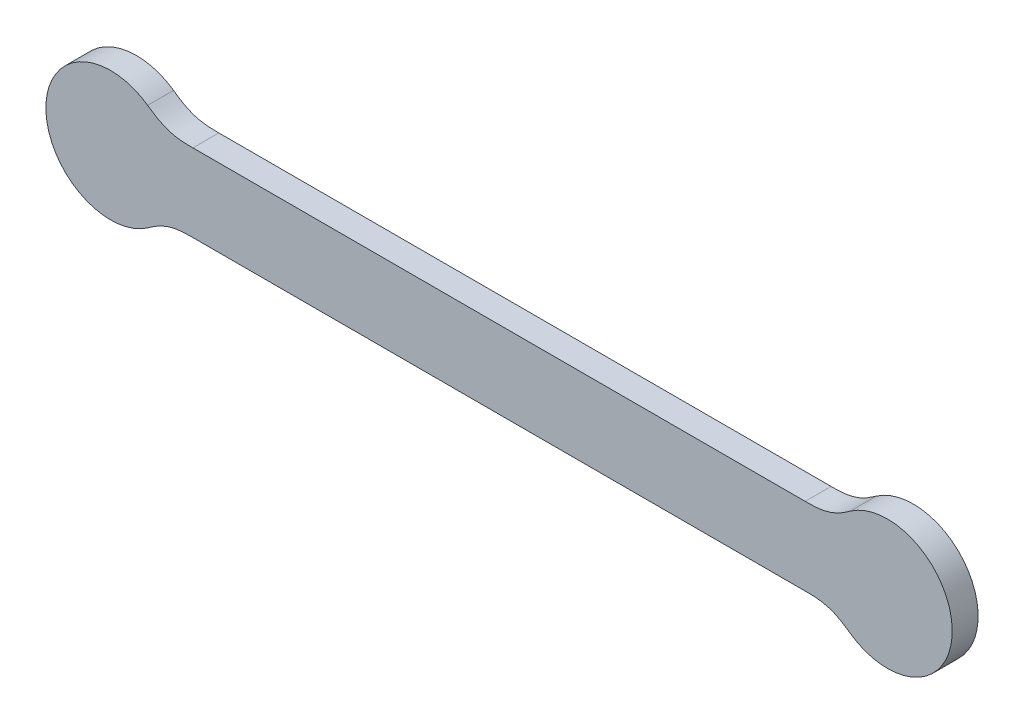
ISO-10303-21;
HEADER;
FILE_DESCRIPTION(('STEP AP214'),'2;1');
FILE_NAME('part.step','',(''),(''),'','','');
FILE_SCHEMA(('AUTOMOTIVE_DESIGN { 1 0 10303 214 1 1 1 1 }'));
ENDSEC;
DATA;
#1=APPLICATION_CONTEXT('core data for automotive mechanical design processes');
#2=APPLICATION_PROTOCOL_DEFINITION('international standard','automotive_design',2000,#1);
#3=PRODUCT_CONTEXT('',#1,'mechanical');
#4=PRODUCT('Part','Part','',(#3));
#5=PRODUCT_RELATED_PRODUCT_CATEGORY('part','',(#4));
#6=PRODUCT_DEFINITION_FORMATION('','',#4);
#7=PRODUCT_DEFINITION_CONTEXT('part definition',#1,'design');
#8=PRODUCT_DEFINITION('design','',#6,#7);
#9=PRODUCT_DEFINITION_SHAPE('','',#8);
#10=(LENGTH_UNIT() NAMED_UNIT(*) SI_UNIT(.MILLI.,.METRE.));
#11=(NAMED_UNIT(*) PLANE_ANGLE_UNIT() SI_UNIT($,.RADIAN.));
#12=(NAMED_UNIT(*) SI_UNIT($,.STERADIAN.) SOLID_ANGLE_UNIT());
#13=UNCERTAINTY_MEASURE_WITH_UNIT(LENGTH_MEASURE(1.E-05),#10,'distance_accuracy_value','');
#14=(GEOMETRIC_REPRESENTATION_CONTEXT(3) GLOBAL_UNCERTAINTY_ASSIGNED_CONTEXT((#13)) GLOBAL_UNIT_ASSIGNED_CONTEXT((#10,
#11,#12)) REPRESENTATION_CONTEXT('',''));
#15=CARTESIAN_POINT('',(0.,0.,0.));
#16=DIRECTION('',(0.,0.,1.));
#17=DIRECTION('',(1.,0.,0.));
#18=AXIS2_PLACEMENT_3D('',#15,#16,#17);
#19=CARTESIAN_POINT('',(63.560994328244,30.0000000000608,20.));
#20=CARTESIAN_POINT('',(62.7872582769109,29.9999911086348,20.));
#21=CARTESIAN_POINT('',(62.3868019946968,30.000683506393,20.));
#22=CARTESIAN_POINT('',(61.7360385844248,30.0018086907049,20.));
#23=CARTESIAN_POINT('',(61.2128180486898,30.0053667871525,20.));
#24=CARTESIAN_POINT('',(60.5917110680237,30.0095905482447,20.));
#25=CARTESIAN_POINT('',(60.0392431796509,30.017901856522,20.));
#26=CARTESIAN_POINT('',(59.427508131008,30.0271047779594,20.));
#27=CARTESIAN_POINT('',(58.8662616132109,30.0418247272716,20.));
#28=CARTESIAN_POINT('',(57.630767285642,30.0742283383421,20.));
#29=CARTESIAN_POINT('',(56.5227550754297,30.1368221512111,20.));
#30=CARTESIAN_POINT('',(55.3124578234751,30.2051942494664,20.));
#31=CARTESIAN_POINT('',(54.183496162657,30.3133481377789,20.));
#32=CARTESIAN_POINT('',(52.9879711189895,30.4278787605052,20.));
#33=CARTESIAN_POINT('',(51.8494677845407,30.5902685733549,20.));
#34=CARTESIAN_POINT('',(50.6704786241827,30.758433060282,20.));
#35=CARTESIAN_POINT('',(49.5345075933127,30.9805860734805,20.));
#36=CARTESIAN_POINT('',(48.379387223232,31.2064839739083,20.));
#37=CARTESIAN_POINT('',(47.2586696989515,31.4902667294088,20.));
#38=CARTESIAN_POINT('',(46.1270551473777,31.7768087782772,20.));
#39=CARTESIAN_POINT('',(45.0237226557853,32.1242714707231,20.));
#40=CARTESIAN_POINT('',(43.9238417271821,32.4706471931227,20.));
#41=CARTESIAN_POINT('',(42.8305282302557,32.8852204024476,20.));
#42=CARTESIAN_POINT('',(41.7598509961034,33.2912101742391,20.));
#43=CARTESIAN_POINT('',(40.6777681374749,33.7691054259936,20.));
#44=CARTESIAN_POINT('',(39.6275067291394,34.2329469295739,20.));
#45=CARTESIAN_POINT('',(38.5622971291976,34.7663637638698,20.));
#46=CARTESIAN_POINT('',(37.5289508574445,35.283824643907,20.));
#47=CARTESIAN_POINT('',(36.4849799236338,35.8652119956421,20.));
#48=CARTESIAN_POINT('',(35.4746795814725,36.4278481968648,20.));
#49=CARTESIAN_POINT('',(34.45873878953,37.0481852005326,20.));
#50=CARTESIAN_POINT('',(33.4784989283344,37.6467230909219,20.));
#51=CARTESIAN_POINT('',(32.4808720459842,38.3070516798302,20.));
#52=CARTESIAN_POINT('',(32.0046966142756,38.6222318904439,20.));
#53=CARTESIAN_POINT('',(31.5084478581512,38.9623857321312,20.));
#54=CARTESIAN_POINT('',(31.0539115406918,39.2739477716571,20.));
#55=CARTESIAN_POINT('',(30.5453432685858,39.6323410503651,20.));
#56=CARTESIAN_POINT('',(30.3305028033462,39.7837413302479,20.));
#57=CARTESIAN_POINT('',(30.0664658567978,39.9715152596076,20.));
#58=CARTESIAN_POINT('',(29.8911606705376,40.0961862349825,20.));
#59=CARTESIAN_POINT('',(29.5885287781165,40.3121647351301,20.));
#60=CARTESIAN_POINT('',(29.2461249392275,40.5565271748465,20.));
#61=CARTESIAN_POINT('',(29.1105906975946,40.6528126392728,20.));
#62=CARTESIAN_POINT('',(28.8427226240291,40.8431099512841,20.));
#63=CARTESIAN_POINT('',(28.6310785262552,40.9909909910236,20.));
#64=B_SPLINE_CURVE_WITH_KNOTS('',2,(#19,#20,#21,#22,#23,#24,#25,#26,#27,#28,#29,#30,#31,#32,#33,
#34,#35,#36,#37,#38,#39,#40,#41,#42,#43,#44,#45,#46,#47,#48,#49,#50,#51,#52,#53,#54,#55,#56,#57,
#58,#59,#60,#61,#62,#63),.UNSPECIFIED.,.F.,.F.,(3,2,2,2,2,2,2,2,2,2,2,2,2,2,2,2,2,2,2,2,2,2,3),
(0.,0.03125,0.0625,0.09375,0.125,0.1875,0.25,0.3125,0.375,0.4375,0.5,0.5625,0.625,0.6875,0.75,
0.8125,0.875,0.90625,0.9375,0.953125,0.96875,0.984375,1.),.UNSPECIFIED.);
#65=DIRECTION('',(0.,0.,-1.));
#66=VECTOR('',#65,1.);
#67=SURFACE_OF_LINEAR_EXTRUSION('',#64,#66);
#68=CARTESIAN_POINT('',(63.560994328244,30.0000000000608,0.));
#69=CARTESIAN_POINT('',(62.7872582769109,29.9999911086348,0.));
#70=CARTESIAN_POINT('',(62.3868019946968,30.000683506393,0.));
#71=CARTESIAN_POINT('',(61.7360385844248,30.0018086907049,0.));
#72=CARTESIAN_POINT('',(61.2128180486898,30.0053667871525,0.));
#73=CARTESIAN_POINT('',(60.5917110680237,30.0095905482447,0.));
#74=CARTESIAN_POINT('',(60.0392431796509,30.017901856522,0.));
#75=CARTESIAN_POINT('',(59.427508131008,30.0271047779594,0.));
#76=CARTESIAN_POINT('',(58.8662616132109,30.0418247272716,0.));
#77=CARTESIAN_POINT('',(57.630767285642,30.0742283383421,0.));
#78=CARTESIAN_POINT('',(56.5227550754297,30.1368221512111,0.));
#79=CARTESIAN_POINT('',(55.3124578234751,30.2051942494664,0.));
#80=CARTESIAN_POINT('',(54.183496162657,30.3133481377789,0.));
#81=CARTESIAN_POINT('',(52.9879711189895,30.4278787605052,0.));
#82=CARTESIAN_POINT('',(51.8494677845407,30.5902685733549,0.));
#83=CARTESIAN_POINT('',(50.6704786241827,30.758433060282,0.));
#84=CARTESIAN_POINT('',(49.5345075933127,30.9805860734805,0.));
#85=CARTESIAN_POINT('',(48.379387223232,31.2064839739083,0.));
#86=CARTESIAN_POINT('',(47.2586696989515,31.4902667294088,0.));
#87=CARTESIAN_POINT('',(46.1270551473777,31.7768087782772,0.));
#88=CARTESIAN_POINT('',(45.0237226557853,32.1242714707231,0.));
#89=CARTESIAN_POINT('',(43.9238417271821,32.4706471931227,0.));
#90=CARTESIAN_POINT('',(42.8305282302557,32.8852204024476,0.));
#91=CARTESIAN_POINT('',(41.7598509961034,33.2912101742391,0.));
#92=CARTESIAN_POINT('',(40.6777681374749,33.7691054259936,0.));
#93=CARTESIAN_POINT('',(39.6275067291394,34.2329469295739,0.));
#94=CARTESIAN_POINT('',(38.5622971291976,34.7663637638698,0.));
#95=CARTESIAN_POINT('',(37.5289508574445,35.283824643907,0.));
#96=CARTESIAN_POINT('',(36.4849799236338,35.8652119956421,0.));
#97=CARTESIAN_POINT('',(35.4746795814725,36.4278481968648,0.));
#98=CARTESIAN_POINT('',(34.45873878953,37.0481852005326,0.));
#99=CARTESIAN_POINT('',(33.4784989283344,37.6467230909219,0.));
#100=CARTESIAN_POINT('',(32.4808720459842,38.3070516798302,0.));
#101=CARTESIAN_POINT('',(32.0046966142756,38.6222318904439,0.));
#102=CARTESIAN_POINT('',(31.5084478581512,38.9623857321312,0.));
#103=CARTESIAN_POINT('',(31.0539115406918,39.2739477716571,0.));
#104=CARTESIAN_POINT('',(30.5453432685858,39.6323410503651,0.));
#105=CARTESIAN_POINT('',(30.3305028033462,39.7837413302479,0.));
#106=CARTESIAN_POINT('',(30.0664658567978,39.9715152596076,0.));
#107=CARTESIAN_POINT('',(29.8911606705376,40.0961862349825,0.));
#108=CARTESIAN_POINT('',(29.5885287781165,40.3121647351301,0.));
#109=CARTESIAN_POINT('',(29.2461249392275,40.5565271748465,0.));
#110=CARTESIAN_POINT('',(29.1105906975946,40.6528126392728,0.));
#111=CARTESIAN_POINT('',(28.8427226240291,40.8431099512841,0.));
#112=CARTESIAN_POINT('',(28.6310785262552,40.9909909910236,0.));
#113=B_SPLINE_CURVE_WITH_KNOTS('',2,(#68,#69,#70,#71,#72,#73,#74,#75,#76,#77,#78,#79,#80,#81,
#82,#83,#84,#85,#86,#87,#88,#89,#90,#91,#92,#93,#94,#95,#96,#97,#98,#99,#100,#101,#102,#103,
#104,#105,#106,#107,#108,#109,#110,#111,#112),.UNSPECIFIED.,.F.,.F.,(3,2,2,2,2,2,2,2,2,2,2,2,2,
2,2,2,2,2,2,2,2,2,3),(0.,0.03125,0.0625,0.09375,0.125,0.1875,0.25,0.3125,0.375,0.4375,0.5,
0.5625,0.625,0.6875,0.75,0.8125,0.875,0.90625,0.9375,0.953125,0.96875,0.984375,1.),.UNSPECIFIED.);
#114=CARTESIAN_POINT('',(63.560994328244,30.0000000000608,0.));
#115=VERTEX_POINT('',#114);
#116=CARTESIAN_POINT('',(28.6310785262552,40.9909909910236,0.));
#117=VERTEX_POINT('',#116);
#118=EDGE_CURVE('E343',#115,#117,#113,.T.);
#119=ORIENTED_EDGE('',*,*,#118,.T.);
#120=DIRECTION('',(0.,0.,-1.));
#121=VECTOR('',#120,1.);
#122=CARTESIAN_POINT('',(28.6310785262552,40.9909909910236,20.));
#123=LINE('',#122,#121);
#124=CARTESIAN_POINT('',(28.6310785262552,40.9909909910236,20.));
#125=VERTEX_POINT('',#124);
#126=EDGE_CURVE('E12',#125,#117,#123,.T.);
#127=ORIENTED_EDGE('',*,*,#126,.F.);
#128=CARTESIAN_POINT('',(28.6310785262552,40.9909909910236,20.));
#129=CARTESIAN_POINT('',(28.8427226240291,40.8431099512841,20.));
#130=CARTESIAN_POINT('',(29.1105906975946,40.6528126392728,20.));
#131=CARTESIAN_POINT('',(29.2461249392275,40.5565271748465,20.));
#132=CARTESIAN_POINT('',(29.5885287781165,40.3121647351301,20.));
#133=CARTESIAN_POINT('',(29.8911606705376,40.0961862349825,20.));
#134=CARTESIAN_POINT('',(30.0664658567978,39.9715152596076,20.));
#135=CARTESIAN_POINT('',(30.3305028033462,39.7837413302479,20.));
#136=CARTESIAN_POINT('',(30.5453432685858,39.6323410503651,20.));
#137=CARTESIAN_POINT('',(31.0539115406918,39.2739477716571,20.));
#138=CARTESIAN_POINT('',(31.5084478581512,38.9623857321312,20.));
#139=CARTESIAN_POINT('',(32.0046966142756,38.6222318904439,20.));
#140=CARTESIAN_POINT('',(32.4808720459842,38.3070516798302,20.));
#141=CARTESIAN_POINT('',(33.4784989283344,37.6467230909219,20.));
#142=CARTESIAN_POINT('',(34.45873878953,37.0481852005326,20.));
#143=CARTESIAN_POINT('',(35.4746795814725,36.4278481968648,20.));
#144=CARTESIAN_POINT('',(36.4849799236338,35.8652119956421,20.));
#145=CARTESIAN_POINT('',(37.5289508574445,35.283824643907,20.));
#146=CARTESIAN_POINT('',(38.5622971291976,34.7663637638698,20.));
#147=CARTESIAN_POINT('',(39.6275067291394,34.2329469295739,20.));
#148=CARTESIAN_POINT('',(40.6777681374749,33.7691054259936,20.));
#149=CARTESIAN_POINT('',(41.7598509961034,33.2912101742391,20.));
#150=CARTESIAN_POINT('',(42.8305282302557,32.8852204024476,20.));
#151=CARTESIAN_POINT('',(43.9238417271821,32.4706471931227,20.));
#152=CARTESIAN_POINT('',(45.0237226557853,32.1242714707231,20.));
#153=CARTESIAN_POINT('',(46.1270551473777,31.7768087782772,20.));
#154=CARTESIAN_POINT('',(47.2586696989515,31.4902667294088,20.));
#155=CARTESIAN_POINT('',(48.379387223232,31.2064839739083,20.));
#156=CARTESIAN_POINT('',(49.5345075933127,30.9805860734805,20.));
#157=CARTESIAN_POINT('',(50.6704786241827,30.758433060282,20.));
#158=CARTESIAN_POINT('',(51.8494677845407,30.5902685733549,20.));
#159=CARTESIAN_POINT('',(52.9879711189895,30.4278787605052,20.));
#160=CARTESIAN_POINT('',(54.183496162657,30.3133481377789,20.));
#161=CARTESIAN_POINT('',(55.3124578234751,30.2051942494664,20.));
#162=CARTESIAN_POINT('',(56.5227550754297,30.1368221512111,20.));
#163=CARTESIAN_POINT('',(57.630767285642,30.0742283383421,20.));
#164=CARTESIAN_POINT('',(58.8662616132109,30.0418247272716,20.));
#165=CARTESIAN_POINT('',(59.427508131008,30.0271047779594,20.));
#166=CARTESIAN_POINT('',(60.0392431796509,30.017901856522,20.));
#167=CARTESIAN_POINT('',(60.5917110680237,30.0095905482447,20.));
#168=CARTESIAN_POINT('',(61.2128180486898,30.0053667871525,20.));
#169=CARTESIAN_POINT('',(61.7360385844248,30.0018086907049,20.));
#170=CARTESIAN_POINT('',(62.3868019946968,30.000683506393,20.));
#171=CARTESIAN_POINT('',(62.7872582769109,29.9999911086348,20.));
#172=CARTESIAN_POINT('',(63.560994328244,30.0000000000608,20.));
#173=B_SPLINE_CURVE_WITH_KNOTS('',2,(#128,#129,#130,#131,#132,#133,#134,#135,#136,#137,#138,
#139,#140,#141,#142,#143,#144,#145,#146,#147,#148,#149,#150,#151,#152,#153,#154,#155,#156,#157,
#158,#159,#160,#161,#162,#163,#164,#165,#166,#167,#168,#169,#170,#171,#172),.UNSPECIFIED.,.F.,
.F.,(3,2,2,2,2,2,2,2,2,2,2,2,2,2,2,2,2,2,2,2,2,2,3),(0.,0.015625,0.03125,0.046875,0.0625,
0.09375,0.125,0.1875,0.25,0.3125,0.375,0.4375,0.5,0.5625,0.625,0.6875,0.75,0.8125,0.875,0.90625,
0.9375,0.96875,1.),.UNSPECIFIED.);
#174=CARTESIAN_POINT('',(63.560994328244,30.0000000000608,20.));
#175=VERTEX_POINT('',#174);
#176=EDGE_CURVE('E286',#175,#125,#173,.F.);
#177=ORIENTED_EDGE('',*,*,#176,.F.);
#178=DIRECTION('',(0.,0.,-1.));
#179=VECTOR('',#178,1.);
#180=CARTESIAN_POINT('',(63.560994328244,30.0000000000608,20.));
#181=LINE('',#180,#179);
#182=EDGE_CURVE('E374',#175,#115,#181,.T.);
#183=ORIENTED_EDGE('',*,*,#182,.T.);
#184=EDGE_LOOP('',(#119,#127,#177,#183));
#185=FACE_BOUND('',#184,.T.);
#186=ADVANCED_FACE('F38',(#185),#67,.F.);
#187=CARTESIAN_POINT('',(0.,-4.038869932943E-11,20.));
#188=DIRECTION('',(0.,0.,-1.));
#189=DIRECTION('',(-1.,0.,0.));
#190=AXIS2_PLACEMENT_3D('',#187,#188,#189);
#191=CYLINDRICAL_SURFACE('',#190,50.0000000000607);
#192=CARTESIAN_POINT('',(0.,-4.038869932943E-11,0.));
#193=DIRECTION('',(0.,0.,1.));
#194=DIRECTION('',(1.,0.,0.));
#195=AXIS2_PLACEMENT_3D('',#192,#193,#194);
#196=CIRCLE('',#195,50.0000000000607);
#197=CARTESIAN_POINT('',(28.6310785263075,-40.9909909910678,0.));
#198=VERTEX_POINT('',#197);
#199=EDGE_CURVE('E340',#117,#198,#196,.T.);
#200=ORIENTED_EDGE('',*,*,#199,.T.);
#201=DIRECTION('',(0.,0.,-1.));
#202=VECTOR('',#201,1.);
#203=CARTESIAN_POINT('',(28.6310785263075,-40.9909909910678,20.));
#204=LINE('',#203,#202);
#205=CARTESIAN_POINT('',(28.6310785263075,-40.9909909910678,20.));
#206=VERTEX_POINT('',#205);
#207=EDGE_CURVE('E52',#206,#198,#204,.T.);
#208=ORIENTED_EDGE('',*,*,#207,.F.);
#209=CARTESIAN_POINT('',(0.,-4.038869932943E-11,20.));
#210=DIRECTION('',(0.,0.,1.));
#211=DIRECTION('',(1.,0.,0.));
#212=AXIS2_PLACEMENT_3D('',#209,#210,#211);
#213=CIRCLE('',#212,50.0000000000607);
#214=EDGE_CURVE('E105',#125,#206,#213,.T.);
#215=ORIENTED_EDGE('',*,*,#214,.F.);
#216=ORIENTED_EDGE('',*,*,#126,.T.);
#217=EDGE_LOOP('',(#200,#208,#215,#216));
#218=FACE_BOUND('',#217,.T.);
#219=ADVANCED_FACE('F273',(#218),#191,.T.);
#220=CARTESIAN_POINT('',(28.6310785263075,-40.9909909910678,20.));
#221=CARTESIAN_POINT('',(28.8423316236983,-40.8433832907698,20.));
#222=CARTESIAN_POINT('',(29.110430921913,-40.6529260935813,20.));
#223=CARTESIAN_POINT('',(29.2456441806587,-40.5568708690622,20.));
#224=CARTESIAN_POINT('',(29.5882382815007,-40.3123720693596,20.));
#225=CARTESIAN_POINT('',(29.8901004871767,-40.0969423617786,20.));
#226=CARTESIAN_POINT('',(30.0660439271277,-39.9718152842582,20.));
#227=CARTESIAN_POINT('',(30.3291626089841,-39.7846911055397,20.));
#228=CARTESIAN_POINT('',(30.5447716018993,-39.6327439328909,20.));
#229=CARTESIAN_POINT('',(31.0522487463738,-39.2751071003812,20.));
#230=CARTESIAN_POINT('',(31.5074734932845,-38.9630536430185,20.));
#231=CARTESIAN_POINT('',(32.0025269885528,-38.6236978504647,20.));
#232=CARTESIAN_POINT('',(32.4793126888117,-38.3080839630025,20.));
#233=CARTESIAN_POINT('',(33.4752052966464,-37.6488411684242,20.));
#234=CARTESIAN_POINT('',(34.4553402564401,-37.0502605881829,20.));
#235=CARTESIAN_POINT('',(35.4690472058236,-36.4311771773796,20.));
#236=CARTESIAN_POINT('',(36.478708489062,-35.8687051638327,20.));
#237=CARTESIAN_POINT('',(37.5203821388376,-35.288399387059,20.));
#238=CARTESIAN_POINT('',(38.5538670948265,-34.7705863708479,20.));
#239=CARTESIAN_POINT('',(39.6224137498922,-34.2352061863416,20.));
#240=CARTESIAN_POINT('',(40.6782097692361,-33.7689103816151,20.));
#241=CARTESIAN_POINT('',(41.7627766450492,-33.2899078329494,20.));
#242=CARTESIAN_POINT('',(42.8374461805422,-32.882597911742,20.));
#243=CARTESIAN_POINT('',(43.9312606111946,-32.4680318941428,20.));
#244=CARTESIAN_POINT('',(45.03358197743,-32.1211675772975,20.));
#245=CARTESIAN_POINT('',(46.1354299153353,-31.7744522327929,20.));
#246=CARTESIAN_POINT('',(47.2676166841441,-31.4880021642029,20.));
#247=CARTESIAN_POINT('',(48.3849371924496,-31.2053133490192,20.));
#248=CARTESIAN_POINT('',(49.5385721884592,-30.9797913532913,20.));
#249=CARTESIAN_POINT('',(50.6690242894101,-30.7588013393242,20.));
#250=CARTESIAN_POINT('',(51.84479394927,-30.5909355221532,20.));
#251=CARTESIAN_POINT('',(52.982171569797,-30.4285509750605,20.));
#252=CARTESIAN_POINT('',(54.179318923496,-30.3137485167954,20.));
#253=CARTESIAN_POINT('',(55.3081505146757,-30.2054973134374,20.));
#254=CARTESIAN_POINT('',(56.5204973826881,-30.1369497469401,20.));
#255=CARTESIAN_POINT('',(57.6280168846641,-30.0743292472202,20.));
#256=CARTESIAN_POINT('',(58.8651980183634,-30.0418526347757,20.));
#257=CARTESIAN_POINT('',(59.4255485991439,-30.0271431567944,20.));
#258=CARTESIAN_POINT('',(60.0385660764652,-30.0179119433742,20.));
#259=CARTESIAN_POINT('',(60.5900680022349,-30.0096070708921,20.));
#260=CARTESIAN_POINT('',(61.2124255137652,-30.0053694590248,20.));
#261=CARTESIAN_POINT('',(61.7346904729739,-30.0018133740607,20.));
#262=CARTESIAN_POINT('',(62.386623659473,-30.0006837743087,20.));
#263=CARTESIAN_POINT('',(62.7863671287599,-29.9999911417919,20.));
#264=CARTESIAN_POINT('',(63.5609943283602,-30.0000000000604,20.));
#265=B_SPLINE_CURVE_WITH_KNOTS('',2,(#220,#221,#222,#223,#224,#225,#226,#227,#228,#229,#230,
#231,#232,#233,#234,#235,#236,#237,#238,#239,#240,#241,#242,#243,#244,#245,#246,#247,#248,#249,
#250,#251,#252,#253,#254,#255,#256,#257,#258,#259,#260,#261,#262,#263,#264),.UNSPECIFIED.,.F.,
.F.,(3,2,2,2,2,2,2,2,2,2,2,2,2,2,2,2,2,2,2,2,2,2,3),(0.,0.015625,0.03125,0.046875,0.0625,
0.09375,0.125,0.1875,0.25,0.3125,0.375,0.4375,0.5,0.5625,0.625,0.6875,0.75,0.8125,0.875,0.90625,
0.9375,0.96875,1.),.UNSPECIFIED.);
#266=DIRECTION('',(0.,0.,-1.));
#267=VECTOR('',#266,1.);
#268=SURFACE_OF_LINEAR_EXTRUSION('',#265,#267);
#269=CARTESIAN_POINT('',(28.6310785263075,-40.9909909910678,0.));
#270=CARTESIAN_POINT('',(28.8423316236983,-40.8433832907698,0.));
#271=CARTESIAN_POINT('',(29.110430921913,-40.6529260935813,0.));
#272=CARTESIAN_POINT('',(29.2456441806587,-40.5568708690622,0.));
#273=CARTESIAN_POINT('',(29.5882382815007,-40.3123720693596,0.));
#274=CARTESIAN_POINT('',(29.8901004871767,-40.0969423617786,0.));
#275=CARTESIAN_POINT('',(30.0660439271277,-39.9718152842582,0.));
#276=CARTESIAN_POINT('',(30.3291626089841,-39.7846911055397,0.));
#277=CARTESIAN_POINT('',(30.5447716018993,-39.6327439328909,0.));
#278=CARTESIAN_POINT('',(31.0522487463738,-39.2751071003812,0.));
#279=CARTESIAN_POINT('',(31.5074734932845,-38.9630536430185,0.));
#280=CARTESIAN_POINT('',(32.0025269885528,-38.6236978504647,0.));
#281=CARTESIAN_POINT('',(32.4793126888117,-38.3080839630025,0.));
#282=CARTESIAN_POINT('',(33.4752052966464,-37.6488411684242,0.));
#283=CARTESIAN_POINT('',(34.4553402564401,-37.0502605881829,0.));
#284=CARTESIAN_POINT('',(35.4690472058236,-36.4311771773796,0.));
#285=CARTESIAN_POINT('',(36.478708489062,-35.8687051638327,0.));
#286=CARTESIAN_POINT('',(37.5203821388376,-35.288399387059,0.));
#287=CARTESIAN_POINT('',(38.5538670948265,-34.7705863708479,0.));
#288=CARTESIAN_POINT('',(39.6224137498922,-34.2352061863416,0.));
#289=CARTESIAN_POINT('',(40.6782097692361,-33.7689103816151,0.));
#290=CARTESIAN_POINT('',(41.7627766450492,-33.2899078329494,0.));
#291=CARTESIAN_POINT('',(42.8374461805422,-32.882597911742,0.));
#292=CARTESIAN_POINT('',(43.9312606111946,-32.4680318941428,0.));
#293=CARTESIAN_POINT('',(45.03358197743,-32.1211675772975,0.));
#294=CARTESIAN_POINT('',(46.1354299153353,-31.7744522327929,0.));
#295=CARTESIAN_POINT('',(47.2676166841441,-31.4880021642029,0.));
#296=CARTESIAN_POINT('',(48.3849371924496,-31.2053133490192,0.));
#297=CARTESIAN_POINT('',(49.5385721884592,-30.9797913532913,0.));
#298=CARTESIAN_POINT('',(50.6690242894101,-30.7588013393242,0.));
#299=CARTESIAN_POINT('',(51.84479394927,-30.5909355221532,0.));
#300=CARTESIAN_POINT('',(52.982171569797,-30.4285509750605,0.));
#301=CARTESIAN_POINT('',(54.179318923496,-30.3137485167954,0.));
#302=CARTESIAN_POINT('',(55.3081505146757,-30.2054973134374,0.));
#303=CARTESIAN_POINT('',(56.5204973826881,-30.1369497469401,0.));
#304=CARTESIAN_POINT('',(57.6280168846641,-30.0743292472202,0.));
#305=CARTESIAN_POINT('',(58.8651980183634,-30.0418526347757,0.));
#306=CARTESIAN_POINT('',(59.4255485991439,-30.0271431567944,0.));
#307=CARTESIAN_POINT('',(60.0385660764652,-30.0179119433742,0.));
#308=CARTESIAN_POINT('',(60.5900680022349,-30.0096070708921,0.));
#309=CARTESIAN_POINT('',(61.2124255137652,-30.0053694590248,0.));
#310=CARTESIAN_POINT('',(61.7346904729739,-30.0018133740607,0.));
#311=CARTESIAN_POINT('',(62.386623659473,-30.0006837743087,0.));
#312=CARTESIAN_POINT('',(62.7863671287599,-29.9999911417919,0.));
#313=CARTESIAN_POINT('',(63.5609943283602,-30.0000000000604,0.));
#314=B_SPLINE_CURVE_WITH_KNOTS('',2,(#269,#270,#271,#272,#273,#274,#275,#276,#277,#278,#279,
#280,#281,#282,#283,#284,#285,#286,#287,#288,#289,#290,#291,#292,#293,#294,#295,#296,#297,#298,
#299,#300,#301,#302,#303,#304,#305,#306,#307,#308,#309,#310,#311,#312,#313),.UNSPECIFIED.,.F.,
.F.,(3,2,2,2,2,2,2,2,2,2,2,2,2,2,2,2,2,2,2,2,2,2,3),(0.,0.015625,0.03125,0.046875,0.0625,
0.09375,0.125,0.1875,0.25,0.3125,0.375,0.4375,0.5,0.5625,0.625,0.6875,0.75,0.8125,0.875,0.90625,
0.9375,0.96875,1.),.UNSPECIFIED.);
#315=CARTESIAN_POINT('',(63.5609943283602,-30.0000000000604,0.));
#316=VERTEX_POINT('',#315);
#317=EDGE_CURVE('E329',#198,#316,#314,.T.);
#318=ORIENTED_EDGE('',*,*,#317,.T.);
#319=DIRECTION('',(0.,0.,-1.));
#320=VECTOR('',#319,1.);
#321=CARTESIAN_POINT('',(63.5609943283602,-30.0000000000604,20.));
#322=LINE('',#321,#320);
#323=CARTESIAN_POINT('',(63.5609943283602,-30.0000000000604,20.));
#324=VERTEX_POINT('',#323);
#325=EDGE_CURVE('E292',#324,#316,#322,.T.);
#326=ORIENTED_EDGE('',*,*,#325,.F.);
#327=CARTESIAN_POINT('',(63.5609943283602,-30.0000000000604,20.));
#328=CARTESIAN_POINT('',(62.7863671287599,-29.9999911417919,20.));
#329=CARTESIAN_POINT('',(62.386623659473,-30.0006837743087,20.));
#330=CARTESIAN_POINT('',(61.7346904729739,-30.0018133740607,20.));
#331=CARTESIAN_POINT('',(61.2124255137652,-30.0053694590248,20.));
#332=CARTESIAN_POINT('',(60.5900680022349,-30.0096070708921,20.));
#333=CARTESIAN_POINT('',(60.0385660764652,-30.0179119433742,20.));
#334=CARTESIAN_POINT('',(59.4255485991439,-30.0271431567944,20.));
#335=CARTESIAN_POINT('',(58.8651980183634,-30.0418526347757,20.));
#336=CARTESIAN_POINT('',(57.6280168846641,-30.0743292472202,20.));
#337=CARTESIAN_POINT('',(56.5204973826881,-30.1369497469401,20.));
#338=CARTESIAN_POINT('',(55.3081505146757,-30.2054973134374,20.));
#339=CARTESIAN_POINT('',(54.179318923496,-30.3137485167954,20.));
#340=CARTESIAN_POINT('',(52.982171569797,-30.4285509750605,20.));
#341=CARTESIAN_POINT('',(51.84479394927,-30.5909355221532,20.));
#342=CARTESIAN_POINT('',(50.6690242894101,-30.7588013393242,20.));
#343=CARTESIAN_POINT('',(49.5385721884592,-30.9797913532913,20.));
#344=CARTESIAN_POINT('',(48.3849371924496,-31.2053133490192,20.));
#345=CARTESIAN_POINT('',(47.2676166841441,-31.4880021642029,20.));
#346=CARTESIAN_POINT('',(46.1354299153353,-31.7744522327929,20.));
#347=CARTESIAN_POINT('',(45.03358197743,-32.1211675772975,20.));
#348=CARTESIAN_POINT('',(43.9312606111946,-32.4680318941428,20.));
#349=CARTESIAN_POINT('',(42.8374461805422,-32.882597911742,20.));
#350=CARTESIAN_POINT('',(41.7627766450492,-33.2899078329494,20.));
#351=CARTESIAN_POINT('',(40.6782097692361,-33.7689103816151,20.));
#352=CARTESIAN_POINT('',(39.6224137498922,-34.2352061863416,20.));
#353=CARTESIAN_POINT('',(38.5538670948265,-34.7705863708479,20.));
#354=CARTESIAN_POINT('',(37.5203821388376,-35.288399387059,20.));
#355=CARTESIAN_POINT('',(36.478708489062,-35.8687051638327,20.));
#356=CARTESIAN_POINT('',(35.4690472058236,-36.4311771773796,20.));
#357=CARTESIAN_POINT('',(34.4553402564401,-37.0502605881829,20.));
#358=CARTESIAN_POINT('',(33.4752052966464,-37.6488411684242,20.));
#359=CARTESIAN_POINT('',(32.4793126888117,-38.3080839630025,20.));
#360=CARTESIAN_POINT('',(32.0025269885528,-38.6236978504647,20.));
#361=CARTESIAN_POINT('',(31.5074734932845,-38.9630536430185,20.));
#362=CARTESIAN_POINT('',(31.0522487463738,-39.2751071003812,20.));
#363=CARTESIAN_POINT('',(30.5447716018993,-39.6327439328909,20.));
#364=CARTESIAN_POINT('',(30.3291626089841,-39.7846911055397,20.));
#365=CARTESIAN_POINT('',(30.0660439271277,-39.9718152842582,20.));
#366=CARTESIAN_POINT('',(29.8901004871767,-40.0969423617786,20.));
#367=CARTESIAN_POINT('',(29.5882382815007,-40.3123720693596,20.));
#368=CARTESIAN_POINT('',(29.2456441806587,-40.5568708690622,20.));
#369=CARTESIAN_POINT('',(29.110430921913,-40.6529260935813,20.));
#370=CARTESIAN_POINT('',(28.8423316236983,-40.8433832907698,20.));
#371=CARTESIAN_POINT('',(28.6310785263075,-40.9909909910678,20.));
#372=B_SPLINE_CURVE_WITH_KNOTS('',2,(#327,#328,#329,#330,#331,#332,#333,#334,#335,#336,#337,
#338,#339,#340,#341,#342,#343,#344,#345,#346,#347,#348,#349,#350,#351,#352,#353,#354,#355,#356,
#357,#358,#359,#360,#361,#362,#363,#364,#365,#366,#367,#368,#369,#370,#371),.UNSPECIFIED.,.F.,
.F.,(3,2,2,2,2,2,2,2,2,2,2,2,2,2,2,2,2,2,2,2,2,2,3),(0.,0.03125,0.0625,0.09375,0.125,0.1875,
0.25,0.3125,0.375,0.4375,0.5,0.5625,0.625,0.6875,0.75,0.8125,0.875,0.90625,0.9375,0.953125,
0.96875,0.984375,1.),.UNSPECIFIED.);
#373=EDGE_CURVE('E285',#206,#324,#372,.F.);
#374=ORIENTED_EDGE('',*,*,#373,.F.);
#375=ORIENTED_EDGE('',*,*,#207,.T.);
#376=EDGE_LOOP('',(#318,#326,#374,#375));
#377=FACE_BOUND('',#376,.T.);
#378=ADVANCED_FACE('F265',(#377),#268,.F.);
#379=CARTESIAN_POINT('',(63.5609943283602,-30.0000000000604,20.));
#380=DIRECTION('',(0.,1.,0.));
#381=DIRECTION('',(-1.,0.,0.));
#382=AXIS2_PLACEMENT_3D('',#379,#380,#381);
#383=PLANE('',#382);
#384=DIRECTION('',(1.,0.,0.));
#385=VECTOR('',#384,1.);
#386=CARTESIAN_POINT('',(63.5609943283602,-30.0000000000604,0.));
#387=LINE('',#386,#385);
#388=CARTESIAN_POINT('',(536.439005671698,-30.0000000000605,0.));
#389=VERTEX_POINT('',#388);
#390=EDGE_CURVE('E326',#316,#389,#387,.T.);
#391=ORIENTED_EDGE('',*,*,#390,.T.);
#392=DIRECTION('',(0.,0.,-1.));
#393=VECTOR('',#392,1.);
#394=CARTESIAN_POINT('',(536.439005671698,-30.0000000000605,20.));
#395=LINE('',#394,#393);
#396=CARTESIAN_POINT('',(536.439005671698,-30.0000000000605,20.));
#397=VERTEX_POINT('',#396);
#398=EDGE_CURVE('E298',#397,#389,#395,.T.);
#399=ORIENTED_EDGE('',*,*,#398,.F.);
#400=DIRECTION('',(1.,0.,0.));
#401=VECTOR('',#400,1.);
#402=CARTESIAN_POINT('',(63.5609943283602,-30.0000000000604,20.));
#403=LINE('',#402,#401);
#404=EDGE_CURVE('E428',#324,#397,#403,.T.);
#405=ORIENTED_EDGE('',*,*,#404,.F.);
#406=ORIENTED_EDGE('',*,*,#325,.T.);
#407=EDGE_LOOP('',(#391,#399,#405,#406));
#408=FACE_BOUND('',#407,.T.);
#409=ADVANCED_FACE('F186',(#408),#383,.F.);
#410=CARTESIAN_POINT('',(536.439005671698,-30.0000000000605,20.));
#411=CARTESIAN_POINT('',(537.212741722315,-29.9999911086345,20.));
#412=CARTESIAN_POINT('',(537.613198005246,-30.0006835063927,20.));
#413=CARTESIAN_POINT('',(538.263961414836,-30.0018086907014,20.));
#414=CARTESIAN_POINT('',(538.787181951255,-30.0053667871522,20.));
#415=CARTESIAN_POINT('',(539.408288931354,-30.0095905482388,20.));
#416=CARTESIAN_POINT('',(539.960756820295,-30.0179018565218,20.));
#417=CARTESIAN_POINT('',(540.572491868242,-30.0271047779454,20.));
#418=CARTESIAN_POINT('',(541.133738386736,-30.0418247272714,20.));
#419=CARTESIAN_POINT('',(542.369232713964,-30.074228338323,20.));
#420=CARTESIAN_POINT('',(543.47724492452,-30.136822151211,20.));
#421=CARTESIAN_POINT('',(544.687542176453,-30.2051942494646,20.));
#422=CARTESIAN_POINT('',(545.816503837295,-30.3133481377792,20.));
#423=CARTESIAN_POINT('',(547.012028880962,-30.4278787605051,20.));
#424=CARTESIAN_POINT('',(548.150532215414,-30.5902685733558,20.));
#425=CARTESIAN_POINT('',(549.329521376141,-30.7584330603361,20.));
#426=CARTESIAN_POINT('',(550.465492406644,-30.9805860734822,20.));
#427=CARTESIAN_POINT('',(551.620612776765,-31.2064839739375,20.));
#428=CARTESIAN_POINT('',(552.741330301008,-31.4902667294116,20.));
#429=CARTESIAN_POINT('',(553.87294485184,-31.7768087780752,20.));
#430=CARTESIAN_POINT('',(554.976277344176,-32.1242714707271,20.));
#431=CARTESIAN_POINT('',(556.076158272566,-32.4706471930316,20.));
#432=CARTESIAN_POINT('',(557.169471769708,-32.8852204024532,20.));
#433=CARTESIAN_POINT('',(558.240149004413,-33.2912101744691,20.));
#434=CARTESIAN_POINT('',(559.32223186249,-33.769105426001,20.));
#435=CARTESIAN_POINT('',(560.372493269296,-34.2329469289257,20.));
#436=CARTESIAN_POINT('',(561.43770287077,-34.7663637638793,20.));
#437=CARTESIAN_POINT('',(562.471049142087,-35.2838246435919,20.));
#438=CARTESIAN_POINT('',(563.515020076335,-35.8652119956538,20.));
#439=CARTESIAN_POINT('',(564.5253204204,-36.4278481980176,20.));
#440=CARTESIAN_POINT('',(565.54126121044,-37.0481852005467,20.));
#441=CARTESIAN_POINT('',(566.521501070817,-37.6467230904586,20.));
#442=CARTESIAN_POINT('',(567.519127953988,-38.3070516798469,20.));
#443=CARTESIAN_POINT('',(567.995303383165,-38.6222318887555,20.));
#444=CARTESIAN_POINT('',(568.491552141821,-38.9623857321492,20.));
#445=CARTESIAN_POINT('',(568.946088458305,-39.2739477709799,20.));
#446=CARTESIAN_POINT('',(569.454656731387,-39.6323410503842,20.));
#447=CARTESIAN_POINT('',(569.669497198639,-39.7837413316884,20.));
#448=CARTESIAN_POINT('',(569.933534143175,-39.9715152596274,20.));
#449=CARTESIAN_POINT('',(570.108839330873,-40.0961862360312,20.));
#450=CARTESIAN_POINT('',(570.411471221857,-40.3121647351506,20.));
#451=CARTESIAN_POINT('',(570.753875058167,-40.5565271730236,20.));
#452=CARTESIAN_POINT('',(570.889409302379,-40.652812639294,20.));
#453=CARTESIAN_POINT('',(571.157277373992,-40.8431099499412,20.));
#454=CARTESIAN_POINT('',(571.368921473719,-40.9909909910455,20.));
#455=B_SPLINE_CURVE_WITH_KNOTS('',2,(#410,#411,#412,#413,#414,#415,#416,#417,#418,#419,#420,
#421,#422,#423,#424,#425,#426,#427,#428,#429,#430,#431,#432,#433,#434,#435,#436,#437,#438,#439,
#440,#441,#442,#443,#444,#445,#446,#447,#448,#449,#450,#451,#452,#453,#454),.UNSPECIFIED.,.F.,
.F.,(3,2,2,2,2,2,2,2,2,2,2,2,2,2,2,2,2,2,2,2,2,2,3),(0.,0.03125,0.0625,0.09375,0.125,0.1875,
0.25,0.3125,0.375,0.4375,0.5,0.5625,0.625,0.6875,0.75,0.8125,0.875,0.90625,0.9375,0.953125,
0.96875,0.984375,1.),.UNSPECIFIED.);
#456=DIRECTION('',(0.,0.,-1.));
#457=VECTOR('',#456,1.);
#458=SURFACE_OF_LINEAR_EXTRUSION('',#455,#457);
#459=CARTESIAN_POINT('',(536.439005671698,-30.0000000000605,0.));
#460=CARTESIAN_POINT('',(537.212741722315,-29.9999911086345,0.));
#461=CARTESIAN_POINT('',(537.613198005246,-30.0006835063927,0.));
#462=CARTESIAN_POINT('',(538.263961414836,-30.0018086907014,0.));
#463=CARTESIAN_POINT('',(538.787181951255,-30.0053667871522,0.));
#464=CARTESIAN_POINT('',(539.408288931354,-30.0095905482388,0.));
#465=CARTESIAN_POINT('',(539.960756820295,-30.0179018565218,0.));
#466=CARTESIAN_POINT('',(540.572491868242,-30.0271047779454,0.));
#467=CARTESIAN_POINT('',(541.133738386736,-30.0418247272714,0.));
#468=CARTESIAN_POINT('',(542.369232713964,-30.074228338323,0.));
#469=CARTESIAN_POINT('',(543.47724492452,-30.136822151211,0.));
#470=CARTESIAN_POINT('',(544.687542176453,-30.2051942494646,0.));
#471=CARTESIAN_POINT('',(545.816503837295,-30.3133481377792,0.));
#472=CARTESIAN_POINT('',(547.012028880962,-30.4278787605051,0.));
#473=CARTESIAN_POINT('',(548.150532215414,-30.5902685733558,0.));
#474=CARTESIAN_POINT('',(549.329521376141,-30.7584330603361,0.));
#475=CARTESIAN_POINT('',(550.465492406644,-30.9805860734822,0.));
#476=CARTESIAN_POINT('',(551.620612776765,-31.2064839739375,0.));
#477=CARTESIAN_POINT('',(552.741330301008,-31.4902667294116,0.));
#478=CARTESIAN_POINT('',(553.87294485184,-31.7768087780752,0.));
#479=CARTESIAN_POINT('',(554.976277344176,-32.1242714707271,0.));
#480=CARTESIAN_POINT('',(556.076158272566,-32.4706471930316,0.));
#481=CARTESIAN_POINT('',(557.169471769708,-32.8852204024532,0.));
#482=CARTESIAN_POINT('',(558.240149004413,-33.2912101744691,0.));
#483=CARTESIAN_POINT('',(559.32223186249,-33.769105426001,0.));
#484=CARTESIAN_POINT('',(560.372493269296,-34.2329469289257,0.));
#485=CARTESIAN_POINT('',(561.43770287077,-34.7663637638793,0.));
#486=CARTESIAN_POINT('',(562.471049142087,-35.2838246435919,0.));
#487=CARTESIAN_POINT('',(563.515020076335,-35.8652119956538,0.));
#488=CARTESIAN_POINT('',(564.5253204204,-36.4278481980176,0.));
#489=CARTESIAN_POINT('',(565.54126121044,-37.0481852005467,0.));
#490=CARTESIAN_POINT('',(566.521501070817,-37.6467230904586,0.));
#491=CARTESIAN_POINT('',(567.519127953988,-38.3070516798469,0.));
#492=CARTESIAN_POINT('',(567.995303383165,-38.6222318887555,0.));
#493=CARTESIAN_POINT('',(568.491552141821,-38.9623857321492,0.));
#494=CARTESIAN_POINT('',(568.946088458305,-39.2739477709799,0.));
#495=CARTESIAN_POINT('',(569.454656731387,-39.6323410503842,0.));
#496=CARTESIAN_POINT('',(569.669497198639,-39.7837413316884,0.));
#497=CARTESIAN_POINT('',(569.933534143175,-39.9715152596274,0.));
#498=CARTESIAN_POINT('',(570.108839330873,-40.0961862360312,0.));
#499=CARTESIAN_POINT('',(570.411471221857,-40.3121647351506,0.));
#500=CARTESIAN_POINT('',(570.753875058167,-40.5565271730236,0.));
#501=CARTESIAN_POINT('',(570.889409302379,-40.652812639294,0.));
#502=CARTESIAN_POINT('',(571.157277373992,-40.8431099499412,0.));
#503=CARTESIAN_POINT('',(571.368921473719,-40.9909909910455,0.));
#504=B_SPLINE_CURVE_WITH_KNOTS('',2,(#459,#460,#461,#462,#463,#464,#465,#466,#467,#468,#469,
#470,#471,#472,#473,#474,#475,#476,#477,#478,#479,#480,#481,#482,#483,#484,#485,#486,#487,#488,
#489,#490,#491,#492,#493,#494,#495,#496,#497,#498,#499,#500,#501,#502,#503),.UNSPECIFIED.,.F.,
.F.,(3,2,2,2,2,2,2,2,2,2,2,2,2,2,2,2,2,2,2,2,2,2,3),(0.,0.03125,0.0625,0.09375,0.125,0.1875,
0.25,0.3125,0.375,0.4375,0.5,0.5625,0.625,0.6875,0.75,0.8125,0.875,0.90625,0.9375,0.953125,
0.96875,0.984375,1.),.UNSPECIFIED.);
#505=CARTESIAN_POINT('',(571.368921473719,-40.9909909910455,0.));
#506=VERTEX_POINT('',#505);
#507=EDGE_CURVE('E328',#389,#506,#504,.T.);
#508=ORIENTED_EDGE('',*,*,#507,.T.);
#509=DIRECTION('',(0.,0.,-1.));
#510=VECTOR('',#509,1.);
#511=CARTESIAN_POINT('',(571.368921473719,-40.9909909910455,20.));
#512=LINE('',#511,#510);
#513=CARTESIAN_POINT('',(571.368921473719,-40.9909909910455,20.));
#514=VERTEX_POINT('',#513);
#515=EDGE_CURVE('E137',#514,#506,#512,.T.);
#516=ORIENTED_EDGE('',*,*,#515,.F.);
#517=CARTESIAN_POINT('',(571.368921473719,-40.9909909910455,20.));
#518=CARTESIAN_POINT('',(571.157277373992,-40.8431099499412,20.));
#519=CARTESIAN_POINT('',(570.889409302379,-40.652812639294,20.));
#520=CARTESIAN_POINT('',(570.753875058167,-40.5565271730236,20.));
#521=CARTESIAN_POINT('',(570.411471221857,-40.3121647351506,20.));
#522=CARTESIAN_POINT('',(570.108839330873,-40.0961862360312,20.));
#523=CARTESIAN_POINT('',(569.933534143175,-39.9715152596274,20.));
#524=CARTESIAN_POINT('',(569.669497198639,-39.7837413316884,20.));
#525=CARTESIAN_POINT('',(569.454656731387,-39.6323410503842,20.));
#526=CARTESIAN_POINT('',(568.946088458305,-39.2739477709799,20.));
#527=CARTESIAN_POINT('',(568.491552141821,-38.9623857321492,20.));
#528=CARTESIAN_POINT('',(567.995303383165,-38.6222318887555,20.));
#529=CARTESIAN_POINT('',(567.519127953988,-38.3070516798469,20.));
#530=CARTESIAN_POINT('',(566.521501070817,-37.6467230904586,20.));
#531=CARTESIAN_POINT('',(565.54126121044,-37.0481852005467,20.));
#532=CARTESIAN_POINT('',(564.5253204204,-36.4278481980176,20.));
#533=CARTESIAN_POINT('',(563.515020076335,-35.8652119956538,20.));
#534=CARTESIAN_POINT('',(562.471049142087,-35.2838246435919,20.));
#535=CARTESIAN_POINT('',(561.43770287077,-34.7663637638793,20.));
#536=CARTESIAN_POINT('',(560.372493269296,-34.2329469289257,20.));
#537=CARTESIAN_POINT('',(559.32223186249,-33.769105426001,20.));
#538=CARTESIAN_POINT('',(558.240149004413,-33.2912101744691,20.));
#539=CARTESIAN_POINT('',(557.169471769708,-32.8852204024532,20.));
#540=CARTESIAN_POINT('',(556.076158272566,-32.4706471930316,20.));
#541=CARTESIAN_POINT('',(554.976277344176,-32.1242714707271,20.));
#542=CARTESIAN_POINT('',(553.87294485184,-31.7768087780752,20.));
#543=CARTESIAN_POINT('',(552.741330301008,-31.4902667294116,20.));
#544=CARTESIAN_POINT('',(551.620612776765,-31.2064839739375,20.));
#545=CARTESIAN_POINT('',(550.465492406644,-30.9805860734822,20.));
#546=CARTESIAN_POINT('',(549.329521376141,-30.7584330603361,20.));
#547=CARTESIAN_POINT('',(548.150532215414,-30.5902685733558,20.));
#548=CARTESIAN_POINT('',(547.012028880962,-30.4278787605051,20.));
#549=CARTESIAN_POINT('',(545.816503837295,-30.3133481377792,20.));
#550=CARTESIAN_POINT('',(544.687542176453,-30.2051942494646,20.));
#551=CARTESIAN_POINT('',(543.47724492452,-30.136822151211,20.));
#552=CARTESIAN_POINT('',(542.369232713964,-30.074228338323,20.));
#553=CARTESIAN_POINT('',(541.133738386736,-30.0418247272714,20.));
#554=CARTESIAN_POINT('',(540.572491868242,-30.0271047779454,20.));
#555=CARTESIAN_POINT('',(539.960756820295,-30.0179018565218,20.));
#556=CARTESIAN_POINT('',(539.408288931354,-30.0095905482388,20.));
#557=CARTESIAN_POINT('',(538.787181951255,-30.0053667871522,20.));
#558=CARTESIAN_POINT('',(538.263961414836,-30.0018086907014,20.));
#559=CARTESIAN_POINT('',(537.613198005246,-30.0006835063927,20.));
#560=CARTESIAN_POINT('',(537.212741722315,-29.9999911086345,20.));
#561=CARTESIAN_POINT('',(536.439005671698,-30.0000000000605,20.));
#562=B_SPLINE_CURVE_WITH_KNOTS('',2,(#517,#518,#519,#520,#521,#522,#523,#524,#525,#526,#527,
#528,#529,#530,#531,#532,#533,#534,#535,#536,#537,#538,#539,#540,#541,#542,#543,#544,#545,#546,
#547,#548,#549,#550,#551,#552,#553,#554,#555,#556,#557,#558,#559,#560,#561),.UNSPECIFIED.,.F.,
.F.,(3,2,2,2,2,2,2,2,2,2,2,2,2,2,2,2,2,2,2,2,2,2,3),(0.,0.015625,0.03125,0.046875,0.0625,
0.09375,0.125,0.1875,0.25,0.3125,0.375,0.4375,0.5,0.5625,0.625,0.6875,0.75,0.8125,0.875,0.90625,
0.9375,0.96875,1.),.UNSPECIFIED.);
#563=EDGE_CURVE('E125',#397,#514,#562,.F.);
#564=ORIENTED_EDGE('',*,*,#563,.F.);
#565=ORIENTED_EDGE('',*,*,#398,.T.);
#566=EDGE_LOOP('',(#508,#516,#564,#565));
#567=FACE_BOUND('',#566,.T.);
#568=ADVANCED_FACE('F182',(#567),#458,.F.);
#569=CARTESIAN_POINT('',(600.,1.94289029309402E-13,20.));
#570=DIRECTION('',(0.,0.,-1.));
#571=DIRECTION('',(-1.,0.,0.));
#572=AXIS2_PLACEMENT_3D('',#569,#570,#571);
#573=CYLINDRICAL_SURFACE('',#572,50.0000000000607);
#574=CARTESIAN_POINT('',(600.,1.94289029309402E-13,0.));
#575=DIRECTION('',(0.,0.,1.));
#576=DIRECTION('',(1.,0.,0.));
#577=AXIS2_PLACEMENT_3D('',#574,#575,#576);
#578=CIRCLE('',#577,50.0000000000607);
#579=CARTESIAN_POINT('',(571.368921473719,40.9909909910459,0.));
#580=VERTEX_POINT('',#579);
#581=EDGE_CURVE('E135',#506,#580,#578,.T.);
#582=ORIENTED_EDGE('',*,*,#581,.T.);
#583=DIRECTION('',(0.,0.,-1.));
#584=VECTOR('',#583,1.);
#585=CARTESIAN_POINT('',(571.368921473719,40.9909909910459,20.));
#586=LINE('',#585,#584);
#587=CARTESIAN_POINT('',(571.368921473719,40.9909909910459,20.));
#588=VERTEX_POINT('',#587);
#589=EDGE_CURVE('E132',#588,#580,#586,.T.);
#590=ORIENTED_EDGE('',*,*,#589,.F.);
#591=CARTESIAN_POINT('',(600.,1.94289029309402E-13,20.));
#592=DIRECTION('',(0.,0.,1.));
#593=DIRECTION('',(1.,0.,0.));
#594=AXIS2_PLACEMENT_3D('',#591,#592,#593);
#595=CIRCLE('',#594,50.0000000000607);
#596=EDGE_CURVE('E118',#514,#588,#595,.T.);
#597=ORIENTED_EDGE('',*,*,#596,.F.);
#598=ORIENTED_EDGE('',*,*,#515,.T.);
#599=EDGE_LOOP('',(#582,#590,#597,#598));
#600=FACE_BOUND('',#599,.T.);
#601=ADVANCED_FACE('F133',(#600),#573,.T.);
#602=CARTESIAN_POINT('',(571.368921473719,40.9909909910459,20.));
#603=CARTESIAN_POINT('',(571.157668377205,40.8433832913611,20.));
#604=CARTESIAN_POINT('',(570.889569078113,40.65292609356,20.));
#605=CARTESIAN_POINT('',(570.754355826945,40.5568708744291,20.));
#606=CARTESIAN_POINT('',(570.411761718526,40.312372069339,20.));
#607=CARTESIAN_POINT('',(570.109899503468,40.0969423550799,20.));
#608=CARTESIAN_POINT('',(569.933956072899,39.9718152842382,20.));
#609=CARTESIAN_POINT('',(569.670837389927,39.7846911047359,20.));
#610=CARTESIAN_POINT('',(569.455228398128,39.6327439328716,20.));
#611=CARTESIAN_POINT('',(568.94775125243,39.2751070994959,20.));
#612=CARTESIAN_POINT('',(568.492526506743,38.9630536430006,20.));
#613=CARTESIAN_POINT('',(567.997473011718,38.6236978506442,20.));
#614=CARTESIAN_POINT('',(567.520687311217,38.3080839629858,20.));
#615=CARTESIAN_POINT('',(566.52479470659,37.6488411704557,20.));
#616=CARTESIAN_POINT('',(565.54465974359,37.0502605881687,20.));
#617=CARTESIAN_POINT('',(564.530952794534,36.4311771774752,20.));
#618=CARTESIAN_POINT('',(563.521291510969,35.8687051638209,20.));
#619=CARTESIAN_POINT('',(562.47961785933,35.2883993860857,20.));
#620=CARTESIAN_POINT('',(561.446132905206,34.7705863708383,20.));
#621=CARTESIAN_POINT('',(560.37758625002,34.2352061863017,20.));
#622=CARTESIAN_POINT('',(559.321790230799,33.7689103816077,20.));
#623=CARTESIAN_POINT('',(558.237223355655,33.2899078332153,20.));
#624=CARTESIAN_POINT('',(557.162553819495,32.8825979117364,20.));
#625=CARTESIAN_POINT('',(556.068739388744,32.4680318940814,20.));
#626=CARTESIAN_POINT('',(554.966418022609,32.1211675772935,20.));
#627=CARTESIAN_POINT('',(553.864570084631,31.774452232792,20.));
#628=CARTESIAN_POINT('',(552.732383315897,31.4880021642002,20.));
#629=CARTESIAN_POINT('',(551.615062807741,31.2053133490338,20.));
#630=CARTESIAN_POINT('',(550.461427811584,30.9797913532897,20.));
#631=CARTESIAN_POINT('',(549.330975710501,30.758801339309,20.));
#632=CARTESIAN_POINT('',(548.155206050776,30.5909355221524,20.));
#633=CARTESIAN_POINT('',(547.017828430231,30.4285509750526,20.));
#634=CARTESIAN_POINT('',(545.820681076552,30.3137485167952,20.));
#635=CARTESIAN_POINT('',(544.691849485294,30.2054973134351,20.));
#636=CARTESIAN_POINT('',(543.479502617363,30.1369497469402,20.));
#637=CARTESIAN_POINT('',(542.371983115422,30.0743292472204,20.));
#638=CARTESIAN_POINT('',(541.13480198169,30.041852634776,20.));
#639=CARTESIAN_POINT('',(540.574451400835,30.0271431567932,20.));
#640=CARTESIAN_POINT('',(539.961433923589,30.0179119433746,20.));
#641=CARTESIAN_POINT('',(539.409931997698,30.0096070708911,20.));
#642=CARTESIAN_POINT('',(538.78757448629,30.0053694590252,20.));
#643=CARTESIAN_POINT('',(538.265309527792,30.0018133740665,20.));
#644=CARTESIAN_POINT('',(537.613376340584,30.0006837743091,20.));
#645=CARTESIAN_POINT('',(537.213632872753,29.9999911417923,20.));
#646=CARTESIAN_POINT('',(536.439005671698,30.0000000000609,20.));
#647=B_SPLINE_CURVE_WITH_KNOTS('',2,(#602,#603,#604,#605,#606,#607,#608,#609,#610,#611,#612,
#613,#614,#615,#616,#617,#618,#619,#620,#621,#622,#623,#624,#625,#626,#627,#628,#629,#630,#631,
#632,#633,#634,#635,#636,#637,#638,#639,#640,#641,#642,#643,#644,#645,#646),.UNSPECIFIED.,.F.,
.F.,(3,2,2,2,2,2,2,2,2,2,2,2,2,2,2,2,2,2,2,2,2,2,3),(0.,0.015625,0.03125,0.046875,0.0625,
0.09375,0.125,0.1875,0.25,0.3125,0.375,0.4375,0.5,0.5625,0.625,0.6875,0.75,0.8125,0.875,0.90625,
0.9375,0.96875,1.),.UNSPECIFIED.);
#648=DIRECTION('',(0.,0.,-1.));
#649=VECTOR('',#648,1.);
#650=SURFACE_OF_LINEAR_EXTRUSION('',#647,#649);
#651=CARTESIAN_POINT('',(571.368921473719,40.9909909910459,0.));
#652=CARTESIAN_POINT('',(571.157668377205,40.8433832913611,0.));
#653=CARTESIAN_POINT('',(570.889569078113,40.65292609356,0.));
#654=CARTESIAN_POINT('',(570.754355826945,40.5568708744291,0.));
#655=CARTESIAN_POINT('',(570.411761718526,40.312372069339,0.));
#656=CARTESIAN_POINT('',(570.109899503468,40.0969423550799,0.));
#657=CARTESIAN_POINT('',(569.933956072899,39.9718152842382,0.));
#658=CARTESIAN_POINT('',(569.670837389927,39.7846911047359,0.));
#659=CARTESIAN_POINT('',(569.455228398128,39.6327439328716,0.));
#660=CARTESIAN_POINT('',(568.94775125243,39.2751070994959,0.));
#661=CARTESIAN_POINT('',(568.492526506743,38.9630536430006,0.));
#662=CARTESIAN_POINT('',(567.997473011718,38.6236978506442,0.));
#663=CARTESIAN_POINT('',(567.520687311217,38.3080839629858,0.));
#664=CARTESIAN_POINT('',(566.52479470659,37.6488411704557,0.));
#665=CARTESIAN_POINT('',(565.54465974359,37.0502605881687,0.));
#666=CARTESIAN_POINT('',(564.530952794534,36.4311771774752,0.));
#667=CARTESIAN_POINT('',(563.521291510969,35.8687051638209,0.));
#668=CARTESIAN_POINT('',(562.47961785933,35.2883993860857,0.));
#669=CARTESIAN_POINT('',(561.446132905206,34.7705863708383,0.));
#670=CARTESIAN_POINT('',(560.37758625002,34.2352061863017,0.));
#671=CARTESIAN_POINT('',(559.321790230799,33.7689103816077,0.));
#672=CARTESIAN_POINT('',(558.237223355655,33.2899078332153,0.));
#673=CARTESIAN_POINT('',(557.162553819495,32.8825979117364,0.));
#674=CARTESIAN_POINT('',(556.068739388744,32.4680318940814,0.));
#675=CARTESIAN_POINT('',(554.966418022609,32.1211675772935,0.));
#676=CARTESIAN_POINT('',(553.864570084631,31.774452232792,0.));
#677=CARTESIAN_POINT('',(552.732383315897,31.4880021642002,0.));
#678=CARTESIAN_POINT('',(551.615062807741,31.2053133490338,0.));
#679=CARTESIAN_POINT('',(550.461427811584,30.9797913532897,0.));
#680=CARTESIAN_POINT('',(549.330975710501,30.758801339309,0.));
#681=CARTESIAN_POINT('',(548.155206050776,30.5909355221524,0.));
#682=CARTESIAN_POINT('',(547.017828430231,30.4285509750526,0.));
#683=CARTESIAN_POINT('',(545.820681076552,30.3137485167952,0.));
#684=CARTESIAN_POINT('',(544.691849485294,30.2054973134351,0.));
#685=CARTESIAN_POINT('',(543.479502617363,30.1369497469402,0.));
#686=CARTESIAN_POINT('',(542.371983115422,30.0743292472204,0.));
#687=CARTESIAN_POINT('',(541.13480198169,30.041852634776,0.));
#688=CARTESIAN_POINT('',(540.574451400835,30.0271431567932,0.));
#689=CARTESIAN_POINT('',(539.961433923589,30.0179119433746,0.));
#690=CARTESIAN_POINT('',(539.409931997698,30.0096070708911,0.));
#691=CARTESIAN_POINT('',(538.78757448629,30.0053694590252,0.));
#692=CARTESIAN_POINT('',(538.265309527792,30.0018133740665,0.));
#693=CARTESIAN_POINT('',(537.613376340584,30.0006837743091,0.));
#694=CARTESIAN_POINT('',(537.213632872753,29.9999911417923,0.));
#695=CARTESIAN_POINT('',(536.439005671698,30.0000000000609,0.));
#696=B_SPLINE_CURVE_WITH_KNOTS('',2,(#651,#652,#653,#654,#655,#656,#657,#658,#659,#660,#661,
#662,#663,#664,#665,#666,#667,#668,#669,#670,#671,#672,#673,#674,#675,#676,#677,#678,#679,#680,
#681,#682,#683,#684,#685,#686,#687,#688,#689,#690,#691,#692,#693,#694,#695),.UNSPECIFIED.,.F.,
.F.,(3,2,2,2,2,2,2,2,2,2,2,2,2,2,2,2,2,2,2,2,2,2,3),(0.,0.015625,0.03125,0.046875,0.0625,
0.09375,0.125,0.1875,0.25,0.3125,0.375,0.4375,0.5,0.5625,0.625,0.6875,0.75,0.8125,0.875,0.90625,
0.9375,0.96875,1.),.UNSPECIFIED.);
#697=CARTESIAN_POINT('',(536.439005671698,30.0000000000609,0.));
#698=VERTEX_POINT('',#697);
#699=EDGE_CURVE('E90',#580,#698,#696,.T.);
#700=ORIENTED_EDGE('',*,*,#699,.T.);
#701=DIRECTION('',(0.,0.,-1.));
#702=VECTOR('',#701,1.);
#703=CARTESIAN_POINT('',(536.439005671698,30.0000000000609,20.));
#704=LINE('',#703,#702);
#705=CARTESIAN_POINT('',(536.439005671698,30.0000000000609,20.));
#706=VERTEX_POINT('',#705);
#707=EDGE_CURVE('E138',#706,#698,#704,.T.);
#708=ORIENTED_EDGE('',*,*,#707,.F.);
#709=CARTESIAN_POINT('',(536.439005671698,30.0000000000609,20.));
#710=CARTESIAN_POINT('',(537.213632872753,29.9999911417923,20.));
#711=CARTESIAN_POINT('',(537.613376340584,30.0006837743091,20.));
#712=CARTESIAN_POINT('',(538.265309527792,30.0018133740665,20.));
#713=CARTESIAN_POINT('',(538.78757448629,30.0053694590252,20.));
#714=CARTESIAN_POINT('',(539.409931997698,30.0096070708911,20.));
#715=CARTESIAN_POINT('',(539.961433923589,30.0179119433746,20.));
#716=CARTESIAN_POINT('',(540.574451400835,30.0271431567932,20.));
#717=CARTESIAN_POINT('',(541.13480198169,30.041852634776,20.));
#718=CARTESIAN_POINT('',(542.371983115422,30.0743292472204,20.));
#719=CARTESIAN_POINT('',(543.479502617363,30.1369497469402,20.));
#720=CARTESIAN_POINT('',(544.691849485294,30.2054973134351,20.));
#721=CARTESIAN_POINT('',(545.820681076552,30.3137485167952,20.));
#722=CARTESIAN_POINT('',(547.017828430231,30.4285509750526,20.));
#723=CARTESIAN_POINT('',(548.155206050776,30.5909355221524,20.));
#724=CARTESIAN_POINT('',(549.330975710501,30.758801339309,20.));
#725=CARTESIAN_POINT('',(550.461427811584,30.9797913532897,20.));
#726=CARTESIAN_POINT('',(551.615062807741,31.2053133490338,20.));
#727=CARTESIAN_POINT('',(552.732383315897,31.4880021642002,20.));
#728=CARTESIAN_POINT('',(553.864570084631,31.774452232792,20.));
#729=CARTESIAN_POINT('',(554.966418022609,32.1211675772935,20.));
#730=CARTESIAN_POINT('',(556.068739388744,32.4680318940814,20.));
#731=CARTESIAN_POINT('',(557.162553819495,32.8825979117364,20.));
#732=CARTESIAN_POINT('',(558.237223355655,33.2899078332153,20.));
#733=CARTESIAN_POINT('',(559.321790230799,33.7689103816077,20.));
#734=CARTESIAN_POINT('',(560.37758625002,34.2352061863017,20.));
#735=CARTESIAN_POINT('',(561.446132905206,34.7705863708383,20.));
#736=CARTESIAN_POINT('',(562.47961785933,35.2883993860857,20.));
#737=CARTESIAN_POINT('',(563.521291510969,35.8687051638209,20.));
#738=CARTESIAN_POINT('',(564.530952794534,36.4311771774752,20.));
#739=CARTESIAN_POINT('',(565.54465974359,37.0502605881687,20.));
#740=CARTESIAN_POINT('',(566.52479470659,37.6488411704557,20.));
#741=CARTESIAN_POINT('',(567.520687311217,38.3080839629858,20.));
#742=CARTESIAN_POINT('',(567.997473011718,38.6236978506442,20.));
#743=CARTESIAN_POINT('',(568.492526506743,38.9630536430006,20.));
#744=CARTESIAN_POINT('',(568.94775125243,39.2751070994959,20.));
#745=CARTESIAN_POINT('',(569.455228398128,39.6327439328716,20.));
#746=CARTESIAN_POINT('',(569.670837389927,39.7846911047359,20.));
#747=CARTESIAN_POINT('',(569.933956072899,39.9718152842382,20.));
#748=CARTESIAN_POINT('',(570.109899503468,40.0969423550799,20.));
#749=CARTESIAN_POINT('',(570.411761718526,40.312372069339,20.));
#750=CARTESIAN_POINT('',(570.754355826945,40.5568708744291,20.));
#751=CARTESIAN_POINT('',(570.889569078113,40.65292609356,20.));
#752=CARTESIAN_POINT('',(571.157668377205,40.8433832913611,20.));
#753=CARTESIAN_POINT('',(571.368921473719,40.9909909910459,20.));
#754=B_SPLINE_CURVE_WITH_KNOTS('',2,(#709,#710,#711,#712,#713,#714,#715,#716,#717,#718,#719,
#720,#721,#722,#723,#724,#725,#726,#727,#728,#729,#730,#731,#732,#733,#734,#735,#736,#737,#738,
#739,#740,#741,#742,#743,#744,#745,#746,#747,#748,#749,#750,#751,#752,#753),.UNSPECIFIED.,.F.,
.F.,(3,2,2,2,2,2,2,2,2,2,2,2,2,2,2,2,2,2,2,2,2,2,3),(0.,0.03125,0.0625,0.09375,0.125,0.1875,
0.25,0.3125,0.375,0.4375,0.5,0.5625,0.625,0.6875,0.75,0.8125,0.875,0.90625,0.9375,0.953125,
0.96875,0.984375,1.),.UNSPECIFIED.);
#755=EDGE_CURVE('E122',#588,#706,#754,.F.);
#756=ORIENTED_EDGE('',*,*,#755,.F.);
#757=ORIENTED_EDGE('',*,*,#589,.T.);
#758=EDGE_LOOP('',(#700,#708,#756,#757));
#759=FACE_BOUND('',#758,.T.);
#760=ADVANCED_FACE('F141',(#759),#650,.F.);
#761=CARTESIAN_POINT('',(536.439005671698,30.0000000000609,20.));
#762=DIRECTION('',(0.,-1.,0.));
#763=DIRECTION('',(1.,0.,0.));
#764=AXIS2_PLACEMENT_3D('',#761,#762,#763);
#765=PLANE('',#764);
#766=DIRECTION('',(-1.,0.,0.));
#767=VECTOR('',#766,1.);
#768=CARTESIAN_POINT('',(536.439005671698,30.0000000000609,0.));
#769=LINE('',#768,#767);
#770=EDGE_CURVE('E97',#698,#115,#769,.T.);
#771=ORIENTED_EDGE('',*,*,#770,.T.);
#772=ORIENTED_EDGE('',*,*,#182,.F.);
#773=DIRECTION('',(-1.,0.,0.));
#774=VECTOR('',#773,1.);
#775=CARTESIAN_POINT('',(536.439005671698,30.0000000000609,20.));
#776=LINE('',#775,#774);
#777=EDGE_CURVE('E61',#706,#175,#776,.T.);
#778=ORIENTED_EDGE('',*,*,#777,.F.);
#779=ORIENTED_EDGE('',*,*,#707,.T.);
#780=EDGE_LOOP('',(#771,#772,#778,#779));
#781=FACE_BOUND('',#780,.T.);
#782=ADVANCED_FACE('F162',(#781),#765,.F.);
#783=CARTESIAN_POINT('',(45.0237226557853,32.1242714707231,20.));
#784=DIRECTION('',(0.,0.,1.));
#785=DIRECTION('',(1.,0.,0.));
#786=AXIS2_PLACEMENT_3D('',#783,#784,#785);
#787=PLANE('',#786);
#788=ORIENTED_EDGE('',*,*,#176,.T.);
#789=ORIENTED_EDGE('',*,*,#214,.T.);
#790=ORIENTED_EDGE('',*,*,#373,.T.);
#791=ORIENTED_EDGE('',*,*,#404,.T.);
#792=ORIENTED_EDGE('',*,*,#563,.T.);
#793=ORIENTED_EDGE('',*,*,#596,.T.);
#794=ORIENTED_EDGE('',*,*,#755,.T.);
#795=ORIENTED_EDGE('',*,*,#777,.T.);
#796=EDGE_LOOP('',(#788,#789,#790,#791,#792,#793,#794,#795));
#797=FACE_BOUND('',#796,.T.);
#798=ADVANCED_FACE('F120',(#797),#787,.T.);
#799=CARTESIAN_POINT('',(45.0237226557853,32.1242714707231,0.));
#800=DIRECTION('',(0.,0.,1.));
#801=DIRECTION('',(1.,0.,0.));
#802=AXIS2_PLACEMENT_3D('',#799,#800,#801);
#803=PLANE('',#802);
#804=ORIENTED_EDGE('',*,*,#118,.F.);
#805=ORIENTED_EDGE('',*,*,#770,.F.);
#806=ORIENTED_EDGE('',*,*,#699,.F.);
#807=ORIENTED_EDGE('',*,*,#581,.F.);
#808=ORIENTED_EDGE('',*,*,#507,.F.);
#809=ORIENTED_EDGE('',*,*,#390,.F.);
#810=ORIENTED_EDGE('',*,*,#317,.F.);
#811=ORIENTED_EDGE('',*,*,#199,.F.);
#812=EDGE_LOOP('',(#804,#805,#806,#807,#808,#809,#810,#811));
#813=FACE_BOUND('',#812,.T.);
#814=ADVANCED_FACE('F228',(#813),#803,.F.);
#815=CLOSED_SHELL('',(#186,#219,#378,#409,#568,#601,#760,#782,#798,#814));
#816=MANIFOLD_SOLID_BREP('B2',#815);
#817=ADVANCED_BREP_SHAPE_REPRESENTATION('',(#18,#816),#14);
#818=SHAPE_DEFINITION_REPRESENTATION(#9,#817);
ENDSEC;
END-ISO-10303-21;
